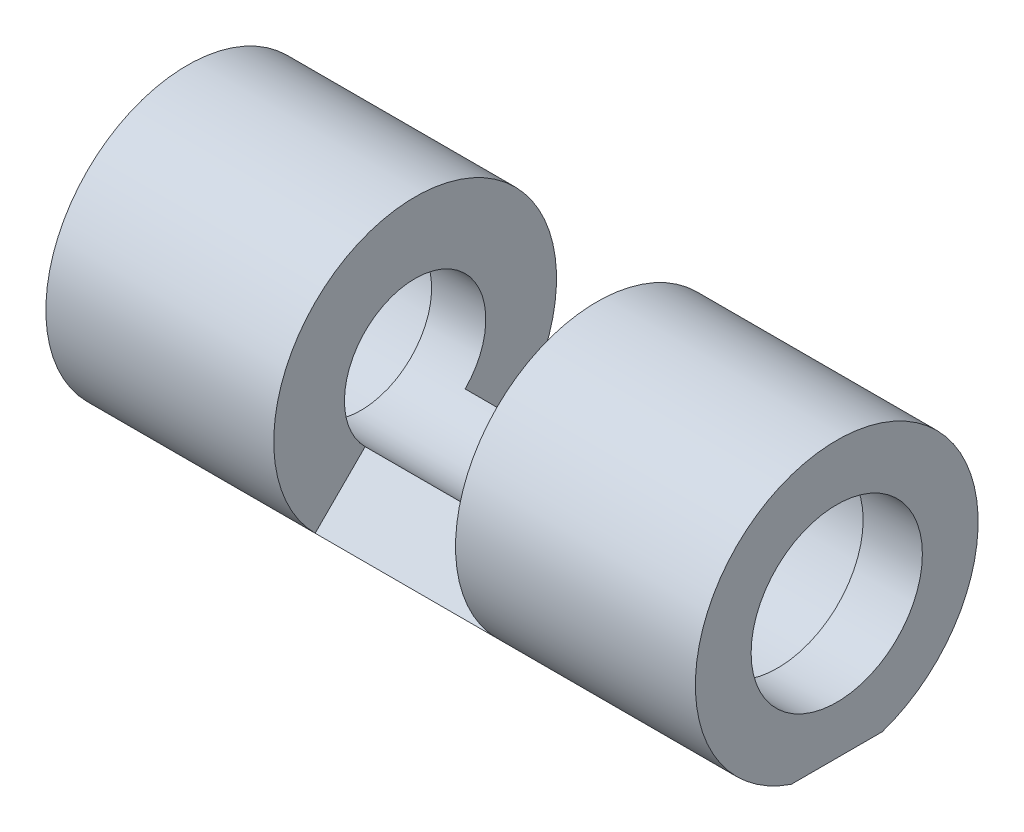
ISO-10303-21;
HEADER;
FILE_DESCRIPTION(('STEP AP214'),'2;1');
FILE_NAME('part.step','',(''),(''),'','','');
FILE_SCHEMA(('AUTOMOTIVE_DESIGN { 1 0 10303 214 1 1 1 1 }'));
ENDSEC;
DATA;
#1=APPLICATION_CONTEXT('core data for automotive mechanical design processes');
#2=APPLICATION_PROTOCOL_DEFINITION('international standard','automotive_design',2000,#1);
#3=PRODUCT_CONTEXT('',#1,'mechanical');
#4=PRODUCT('Part','Part','',(#3));
#5=PRODUCT_RELATED_PRODUCT_CATEGORY('part','',(#4));
#6=PRODUCT_DEFINITION_FORMATION('','',#4);
#7=PRODUCT_DEFINITION_CONTEXT('part definition',#1,'design');
#8=PRODUCT_DEFINITION('design','',#6,#7);
#9=PRODUCT_DEFINITION_SHAPE('','',#8);
#10=(LENGTH_UNIT() NAMED_UNIT(*) SI_UNIT(.MILLI.,.METRE.));
#11=(NAMED_UNIT(*) PLANE_ANGLE_UNIT() SI_UNIT($,.RADIAN.));
#12=(NAMED_UNIT(*) SI_UNIT($,.STERADIAN.) SOLID_ANGLE_UNIT());
#13=UNCERTAINTY_MEASURE_WITH_UNIT(LENGTH_MEASURE(1.E-05),#10,'distance_accuracy_value','');
#14=(GEOMETRIC_REPRESENTATION_CONTEXT(3) GLOBAL_UNCERTAINTY_ASSIGNED_CONTEXT((#13)) GLOBAL_UNIT_ASSIGNED_CONTEXT((#10,
#11,#12)) REPRESENTATION_CONTEXT('',''));
#15=CARTESIAN_POINT('',(0.,0.,0.));
#16=DIRECTION('',(0.,0.,1.));
#17=DIRECTION('',(1.,0.,0.));
#18=AXIS2_PLACEMENT_3D('',#15,#16,#17);
#19=CARTESIAN_POINT('',(21.3682121723614,15.,0.));
#20=DIRECTION('',(-1.,0.,0.));
#21=DIRECTION('',(0.,0.,1.));
#22=AXIS2_PLACEMENT_3D('',#19,#20,#21);
#23=PLANE('',#22);
#24=CARTESIAN_POINT('',(21.3682121723614,0.,0.));
#25=DIRECTION('',(-1.,0.,0.));
#26=DIRECTION('',(0.,0.,1.));
#27=AXIS2_PLACEMENT_3D('',#24,#25,#26);
#28=CIRCLE('',#27,15.);
#29=CARTESIAN_POINT('',(21.3682121723614,0.,15.));
#30=VERTEX_POINT('',#29);
#31=EDGE_CURVE('E106',#30,#30,#28,.T.);
#32=ORIENTED_EDGE('',*,*,#31,.F.);
#33=EDGE_LOOP('',(#32));
#34=FACE_BOUND('',#33,.T.);
#35=CARTESIAN_POINT('',(21.3682121723614,0.,0.));
#36=DIRECTION('',(-1.,0.,0.));
#37=DIRECTION('',(0.,0.,1.));
#38=AXIS2_PLACEMENT_3D('',#35,#36,#37);
#39=CIRCLE('',#38,10.);
#40=CARTESIAN_POINT('',(21.3682121723614,0.,10.));
#41=VERTEX_POINT('',#40);
#42=EDGE_CURVE('E154',#41,#41,#39,.T.);
#43=ORIENTED_EDGE('',*,*,#42,.T.);
#44=EDGE_LOOP('',(#43));
#45=FACE_BOUND('',#44,.T.);
#46=ADVANCED_FACE('F37',(#34,#45),#23,.F.);
#47=CARTESIAN_POINT('',(-29.3839701249643,0.,0.));
#48=DIRECTION('',(-1.,0.,0.));
#49=DIRECTION('',(0.,0.,1.));
#50=AXIS2_PLACEMENT_3D('',#47,#48,#49);
#51=CYLINDRICAL_SURFACE('',#50,15.);
#52=CARTESIAN_POINT('',(37.5600673665024,0.,0.));
#53=DIRECTION('',(-1.,0.,0.));
#54=DIRECTION('',(0.,0.,1.));
#55=AXIS2_PLACEMENT_3D('',#52,#53,#54);
#56=CIRCLE('',#55,15.);
#57=CARTESIAN_POINT('',(37.5600673665024,0.,15.));
#58=VERTEX_POINT('',#57);
#59=EDGE_CURVE('E102',#58,#58,#56,.T.);
#60=ORIENTED_EDGE('',*,*,#59,.F.);
#61=EDGE_LOOP('',(#60));
#62=FACE_BOUND('',#61,.T.);
#63=ORIENTED_EDGE('',*,*,#31,.T.);
#64=EDGE_LOOP('',(#63));
#65=FACE_BOUND('',#64,.T.);
#66=ADVANCED_FACE('F181',(#62,#65),#51,.F.);
#67=CARTESIAN_POINT('',(37.5600673665024,15.,0.));
#68=DIRECTION('',(1.,0.,0.));
#69=DIRECTION('',(0.,0.,-1.));
#70=AXIS2_PLACEMENT_3D('',#67,#68,#69);
#71=PLANE('',#70);
#72=CARTESIAN_POINT('',(37.5600673665024,0.,0.));
#73=DIRECTION('',(1.,0.,0.));
#74=DIRECTION('',(0.,0.,-1.));
#75=AXIS2_PLACEMENT_3D('',#72,#73,#74);
#76=CIRCLE('',#75,12.112305499726);
#77=CARTESIAN_POINT('',(37.5600673665024,0.,-12.112305499726));
#78=VERTEX_POINT('',#77);
#79=EDGE_CURVE('E130',#78,#78,#76,.F.);
#80=ORIENTED_EDGE('',*,*,#79,.F.);
#81=EDGE_LOOP('',(#80));
#82=FACE_BOUND('',#81,.T.);
#83=ORIENTED_EDGE('',*,*,#59,.T.);
#84=EDGE_LOOP('',(#83));
#85=FACE_BOUND('',#84,.T.);
#86=ADVANCED_FACE('F186',(#82,#85),#71,.F.);
#87=CARTESIAN_POINT('',(45.9368923742034,20.,0.));
#88=DIRECTION('',(-1.,0.,0.));
#89=DIRECTION('',(0.,0.,1.));
#90=AXIS2_PLACEMENT_3D('',#87,#88,#89);
#91=PLANE('',#90);
#92=CARTESIAN_POINT('',(45.9368923742034,0.,0.));
#93=DIRECTION('',(-1.,0.,0.));
#94=DIRECTION('',(0.,0.,1.));
#95=AXIS2_PLACEMENT_3D('',#92,#93,#94);
#96=CIRCLE('',#95,12.112305499726);
#97=CARTESIAN_POINT('',(45.9368923742034,0.,12.112305499726));
#98=VERTEX_POINT('',#97);
#99=EDGE_CURVE('E94',#98,#98,#96,.T.);
#100=ORIENTED_EDGE('',*,*,#99,.T.);
#101=EDGE_LOOP('',(#100));
#102=FACE_BOUND('',#101,.T.);
#103=CARTESIAN_POINT('',(45.9368923742034,0.,0.));
#104=DIRECTION('',(-1.,0.,0.));
#105=DIRECTION('',(0.,0.,1.));
#106=AXIS2_PLACEMENT_3D('',#103,#104,#105);
#107=CIRCLE('',#106,20.);
#108=CARTESIAN_POINT('',(45.9368923742034,-18.9369483578658,6.43366045820916));
#109=VERTEX_POINT('',#108);
#110=CARTESIAN_POINT('',(45.9368923742034,-18.9369483578658,-6.43366045820916));
#111=VERTEX_POINT('',#110);
#112=EDGE_CURVE('E99',#109,#111,#107,.T.);
#113=ORIENTED_EDGE('',*,*,#112,.F.);
#114=DIRECTION('',(0.,0.,1.));
#115=VECTOR('',#114,1.);
#116=CARTESIAN_POINT('',(45.9368923742034,-18.9369483578658,23.2785901764984));
#117=LINE('',#116,#115);
#118=EDGE_CURVE('E89',#111,#109,#117,.T.);
#119=ORIENTED_EDGE('',*,*,#118,.F.);
#120=EDGE_LOOP('',(#113,#119));
#121=FACE_BOUND('',#120,.T.);
#122=ADVANCED_FACE('F98',(#102,#121),#91,.F.);
#123=CARTESIAN_POINT('',(-29.3839701249643,0.,0.));
#124=DIRECTION('',(-1.,0.,0.));
#125=DIRECTION('',(0.,0.,1.));
#126=AXIS2_PLACEMENT_3D('',#123,#124,#125);
#127=CYLINDRICAL_SURFACE('',#126,20.);
#128=CARTESIAN_POINT('',(12.0092105655998,0.,0.));
#129=DIRECTION('',(-1.,0.,0.));
#130=DIRECTION('',(0.,0.,1.));
#131=AXIS2_PLACEMENT_3D('',#128,#129,#130);
#132=CIRCLE('',#131,20.);
#133=CARTESIAN_POINT('',(12.0092105655998,-14.1421356237312,14.1421356237307));
#134=VERTEX_POINT('',#133);
#135=CARTESIAN_POINT('',(12.0092105655998,-14.1421356237312,-14.1421356237307));
#136=VERTEX_POINT('',#135);
#137=EDGE_CURVE('E152',#134,#136,#132,.T.);
#138=ORIENTED_EDGE('',*,*,#137,.F.);
#139=DIRECTION('',(-1.,0.,0.));
#140=VECTOR('',#139,1.);
#141=CARTESIAN_POINT('',(-29.3839701249643,-14.1421356237312,14.1421356237307));
#142=LINE('',#141,#140);
#143=CARTESIAN_POINT('',(-13.7019307007708,-14.1421356237312,14.1421356237307));
#144=VERTEX_POINT('',#143);
#145=EDGE_CURVE('E147',#134,#144,#142,.T.);
#146=ORIENTED_EDGE('',*,*,#145,.T.);
#147=CARTESIAN_POINT('',(-13.7019307007708,0.,0.));
#148=DIRECTION('',(1.,0.,0.));
#149=DIRECTION('',(0.,0.,-1.));
#150=AXIS2_PLACEMENT_3D('',#147,#148,#149);
#151=CIRCLE('',#150,20.);
#152=CARTESIAN_POINT('',(-13.7019307007708,-14.1421356237312,-14.1421356237307));
#153=VERTEX_POINT('',#152);
#154=EDGE_CURVE('E150',#153,#144,#151,.T.);
#155=ORIENTED_EDGE('',*,*,#154,.F.);
#156=DIRECTION('',(-1.,0.,0.));
#157=VECTOR('',#156,1.);
#158=CARTESIAN_POINT('',(-29.3839701249643,-14.1421356237312,-14.1421356237307));
#159=LINE('',#158,#157);
#160=EDGE_CURVE('E145',#136,#153,#159,.T.);
#161=ORIENTED_EDGE('',*,*,#160,.F.);
#162=EDGE_LOOP('',(#138,#146,#155,#161));
#163=FACE_BOUND('',#162,.T.);
#164=ORIENTED_EDGE('',*,*,#112,.T.);
#165=DIRECTION('',(-1.,0.,0.));
#166=VECTOR('',#165,1.);
#167=CARTESIAN_POINT('',(-29.3839701249643,-18.9369483578658,-6.43366045820917));
#168=LINE('',#167,#166);
#169=CARTESIAN_POINT('',(-45.9368923742034,-18.9369483578658,-6.43366045820912));
#170=VERTEX_POINT('',#169);
#171=EDGE_CURVE('E86',#111,#170,#168,.T.);
#172=ORIENTED_EDGE('',*,*,#171,.T.);
#173=CARTESIAN_POINT('',(-45.9368923742034,0.,0.));
#174=DIRECTION('',(-1.,0.,0.));
#175=DIRECTION('',(0.,0.,1.));
#176=AXIS2_PLACEMENT_3D('',#173,#174,#175);
#177=CIRCLE('',#176,20.);
#178=CARTESIAN_POINT('',(-45.9368923742034,-18.9369483578658,6.43366045820912));
#179=VERTEX_POINT('',#178);
#180=EDGE_CURVE('E103',#179,#170,#177,.T.);
#181=ORIENTED_EDGE('',*,*,#180,.F.);
#182=DIRECTION('',(-1.,0.,0.));
#183=VECTOR('',#182,1.);
#184=CARTESIAN_POINT('',(-29.3839701249643,-18.9369483578658,6.43366045820917));
#185=LINE('',#184,#183);
#186=EDGE_CURVE('E51',#179,#109,#185,.F.);
#187=ORIENTED_EDGE('',*,*,#186,.T.);
#188=EDGE_LOOP('',(#164,#172,#181,#187));
#189=FACE_BOUND('',#188,.T.);
#190=ADVANCED_FACE('F101',(#163,#189),#127,.T.);
#191=CARTESIAN_POINT('',(-45.9368923742034,20.,0.));
#192=DIRECTION('',(1.,0.,0.));
#193=DIRECTION('',(0.,0.,-1.));
#194=AXIS2_PLACEMENT_3D('',#191,#192,#193);
#195=PLANE('',#194);
#196=CARTESIAN_POINT('',(-45.9368923742034,0.,0.));
#197=DIRECTION('',(-1.,0.,0.));
#198=DIRECTION('',(0.,0.,1.));
#199=AXIS2_PLACEMENT_3D('',#196,#197,#198);
#200=CIRCLE('',#199,12.112305499726);
#201=CARTESIAN_POINT('',(-45.9368923742034,0.,12.112305499726));
#202=VERTEX_POINT('',#201);
#203=EDGE_CURVE('E124',#202,#202,#200,.T.);
#204=ORIENTED_EDGE('',*,*,#203,.F.);
#205=EDGE_LOOP('',(#204));
#206=FACE_BOUND('',#205,.T.);
#207=ORIENTED_EDGE('',*,*,#180,.T.);
#208=DIRECTION('',(0.,0.,1.));
#209=VECTOR('',#208,1.);
#210=CARTESIAN_POINT('',(-45.9368923742034,-18.9369483578658,0.));
#211=LINE('',#210,#209);
#212=EDGE_CURVE('E11',#170,#179,#211,.T.);
#213=ORIENTED_EDGE('',*,*,#212,.T.);
#214=EDGE_LOOP('',(#207,#213));
#215=FACE_BOUND('',#214,.T.);
#216=ADVANCED_FACE('F169',(#206,#215),#195,.F.);
#217=CARTESIAN_POINT('',(-37.5600673665024,15.,0.));
#218=DIRECTION('',(-1.,0.,0.));
#219=DIRECTION('',(0.,0.,1.));
#220=AXIS2_PLACEMENT_3D('',#217,#218,#219);
#221=PLANE('',#220);
#222=CARTESIAN_POINT('',(-37.5600673665024,0.,0.));
#223=DIRECTION('',(-1.,0.,0.));
#224=DIRECTION('',(0.,0.,1.));
#225=AXIS2_PLACEMENT_3D('',#222,#223,#224);
#226=CIRCLE('',#225,12.112305499726);
#227=CARTESIAN_POINT('',(-37.5600673665024,0.,12.112305499726));
#228=VERTEX_POINT('',#227);
#229=EDGE_CURVE('E122',#228,#228,#226,.T.);
#230=ORIENTED_EDGE('',*,*,#229,.T.);
#231=EDGE_LOOP('',(#230));
#232=FACE_BOUND('',#231,.T.);
#233=CARTESIAN_POINT('',(-37.5600673665024,0.,0.));
#234=DIRECTION('',(-1.,0.,0.));
#235=DIRECTION('',(0.,0.,1.));
#236=AXIS2_PLACEMENT_3D('',#233,#234,#235);
#237=CIRCLE('',#236,15.);
#238=CARTESIAN_POINT('',(-37.5600673665024,0.,15.));
#239=VERTEX_POINT('',#238);
#240=EDGE_CURVE('E108',#239,#239,#237,.T.);
#241=ORIENTED_EDGE('',*,*,#240,.F.);
#242=EDGE_LOOP('',(#241));
#243=FACE_BOUND('',#242,.T.);
#244=ADVANCED_FACE('F167',(#232,#243),#221,.F.);
#245=CARTESIAN_POINT('',(-29.3839701249643,0.,0.));
#246=DIRECTION('',(-1.,0.,0.));
#247=DIRECTION('',(0.,0.,1.));
#248=AXIS2_PLACEMENT_3D('',#245,#246,#247);
#249=CYLINDRICAL_SURFACE('',#248,15.);
#250=CARTESIAN_POINT('',(-21.3682121723614,0.,0.));
#251=DIRECTION('',(-1.,0.,0.));
#252=DIRECTION('',(0.,0.,1.));
#253=AXIS2_PLACEMENT_3D('',#250,#251,#252);
#254=CIRCLE('',#253,15.);
#255=CARTESIAN_POINT('',(-21.3682121723614,0.,15.));
#256=VERTEX_POINT('',#255);
#257=EDGE_CURVE('E160',#256,#256,#254,.T.);
#258=ORIENTED_EDGE('',*,*,#257,.F.);
#259=EDGE_LOOP('',(#258));
#260=FACE_BOUND('',#259,.T.);
#261=ORIENTED_EDGE('',*,*,#240,.T.);
#262=EDGE_LOOP('',(#261));
#263=FACE_BOUND('',#262,.T.);
#264=ADVANCED_FACE('F165',(#260,#263),#249,.F.);
#265=CARTESIAN_POINT('',(-21.3682121723614,15.,0.));
#266=DIRECTION('',(1.,0.,0.));
#267=DIRECTION('',(0.,0.,-1.));
#268=AXIS2_PLACEMENT_3D('',#265,#266,#267);
#269=PLANE('',#268);
#270=CARTESIAN_POINT('',(-21.3682121723614,0.,0.));
#271=DIRECTION('',(-1.,0.,0.));
#272=DIRECTION('',(0.,0.,1.));
#273=AXIS2_PLACEMENT_3D('',#270,#271,#272);
#274=CIRCLE('',#273,10.);
#275=CARTESIAN_POINT('',(-21.3682121723614,0.,10.));
#276=VERTEX_POINT('',#275);
#277=EDGE_CURVE('E157',#276,#276,#274,.T.);
#278=ORIENTED_EDGE('',*,*,#277,.F.);
#279=EDGE_LOOP('',(#278));
#280=FACE_BOUND('',#279,.T.);
#281=ORIENTED_EDGE('',*,*,#257,.T.);
#282=EDGE_LOOP('',(#281));
#283=FACE_BOUND('',#282,.T.);
#284=ADVANCED_FACE('F175',(#280,#283),#269,.F.);
#285=CARTESIAN_POINT('',(-29.3839701249643,0.,0.));
#286=DIRECTION('',(-1.,0.,0.));
#287=DIRECTION('',(0.,0.,1.));
#288=AXIS2_PLACEMENT_3D('',#285,#286,#287);
#289=CYLINDRICAL_SURFACE('',#288,10.);
#290=CARTESIAN_POINT('',(-13.7019307007708,0.,0.));
#291=DIRECTION('',(1.,0.,0.));
#292=DIRECTION('',(0.,0.,-1.));
#293=AXIS2_PLACEMENT_3D('',#290,#291,#292);
#294=CIRCLE('',#293,10.);
#295=CARTESIAN_POINT('',(-13.7019307007708,-7.07106781186559,7.07106781186537));
#296=VERTEX_POINT('',#295);
#297=CARTESIAN_POINT('',(-13.7019307007708,-7.07106781186559,-7.07106781186537));
#298=VERTEX_POINT('',#297);
#299=EDGE_CURVE('E116',#296,#298,#294,.F.);
#300=ORIENTED_EDGE('',*,*,#299,.F.);
#301=DIRECTION('',(-1.,0.,0.));
#302=VECTOR('',#301,1.);
#303=CARTESIAN_POINT('',(-29.3839701249643,-7.07106781186559,7.07106781186537));
#304=LINE('',#303,#302);
#305=CARTESIAN_POINT('',(12.0092105655998,-7.07106781186559,7.07106781186537));
#306=VERTEX_POINT('',#305);
#307=EDGE_CURVE('E44',#296,#306,#304,.F.);
#308=ORIENTED_EDGE('',*,*,#307,.T.);
#309=CARTESIAN_POINT('',(12.0092105655998,0.,0.));
#310=DIRECTION('',(-1.,0.,0.));
#311=DIRECTION('',(0.,0.,1.));
#312=AXIS2_PLACEMENT_3D('',#309,#310,#311);
#313=CIRCLE('',#312,10.);
#314=CARTESIAN_POINT('',(12.0092105655998,-7.07106781186559,-7.07106781186537));
#315=VERTEX_POINT('',#314);
#316=EDGE_CURVE('E119',#315,#306,#313,.F.);
#317=ORIENTED_EDGE('',*,*,#316,.F.);
#318=DIRECTION('',(-1.,0.,0.));
#319=VECTOR('',#318,1.);
#320=CARTESIAN_POINT('',(-29.3839701249643,-7.07106781186559,-7.07106781186537));
#321=LINE('',#320,#319);
#322=EDGE_CURVE('E114',#298,#315,#321,.F.);
#323=ORIENTED_EDGE('',*,*,#322,.F.);
#324=EDGE_LOOP('',(#300,#308,#317,#323));
#325=FACE_BOUND('',#324,.T.);
#326=ORIENTED_EDGE('',*,*,#42,.F.);
#327=EDGE_LOOP('',(#326));
#328=FACE_BOUND('',#327,.T.);
#329=ORIENTED_EDGE('',*,*,#277,.T.);
#330=EDGE_LOOP('',(#329));
#331=FACE_BOUND('',#330,.T.);
#332=ADVANCED_FACE('F192',(#325,#328,#331),#289,.F.);
#333=CARTESIAN_POINT('',(12.0092105655998,-6.25976068644332,6.25976068644312));
#334=DIRECTION('',(-1.,0.,0.));
#335=DIRECTION('',(0.,0.,1.));
#336=AXIS2_PLACEMENT_3D('',#333,#334,#335);
#337=PLANE('',#336);
#338=ORIENTED_EDGE('',*,*,#137,.T.);
#339=DIRECTION('',(0.,-0.707106781186559,-0.707106781186536));
#340=VECTOR('',#339,1.);
#341=CARTESIAN_POINT('',(12.0092105655998,-6.25976068644332,-6.25976068644312));
#342=LINE('',#341,#340);
#343=EDGE_CURVE('E58',#315,#136,#342,.T.);
#344=ORIENTED_EDGE('',*,*,#343,.F.);
#345=ORIENTED_EDGE('',*,*,#316,.T.);
#346=DIRECTION('',(0.,-0.707106781186559,0.707106781186536));
#347=VECTOR('',#346,1.);
#348=CARTESIAN_POINT('',(12.0092105655998,-6.25976068644332,6.25976068644312));
#349=LINE('',#348,#347);
#350=EDGE_CURVE('E139',#306,#134,#349,.T.);
#351=ORIENTED_EDGE('',*,*,#350,.T.);
#352=EDGE_LOOP('',(#338,#344,#345,#351));
#353=FACE_BOUND('',#352,.T.);
#354=ADVANCED_FACE('F195',(#353),#337,.T.);
#355=CARTESIAN_POINT('',(-13.7019307007708,-18.2349550431175,18.2349550431169));
#356=DIRECTION('',(1.,0.,0.));
#357=DIRECTION('',(0.,0.,-1.));
#358=AXIS2_PLACEMENT_3D('',#355,#356,#357);
#359=PLANE('',#358);
#360=ORIENTED_EDGE('',*,*,#154,.T.);
#361=DIRECTION('',(0.,0.707106781186559,-0.707106781186536));
#362=VECTOR('',#361,1.);
#363=CARTESIAN_POINT('',(-13.7019307007708,-18.2349550431175,18.2349550431169));
#364=LINE('',#363,#362);
#365=EDGE_CURVE('E142',#144,#296,#364,.T.);
#366=ORIENTED_EDGE('',*,*,#365,.T.);
#367=ORIENTED_EDGE('',*,*,#299,.T.);
#368=DIRECTION('',(0.,0.707106781186559,0.707106781186536));
#369=VECTOR('',#368,1.);
#370=CARTESIAN_POINT('',(-13.7019307007708,-18.2349550431175,-18.2349550431169));
#371=LINE('',#370,#369);
#372=EDGE_CURVE('E127',#153,#298,#371,.T.);
#373=ORIENTED_EDGE('',*,*,#372,.F.);
#374=EDGE_LOOP('',(#360,#366,#367,#373));
#375=FACE_BOUND('',#374,.T.);
#376=ADVANCED_FACE('F209',(#375),#359,.T.);
#377=CARTESIAN_POINT('',(0.,0.,0.));
#378=DIRECTION('',(0.,-0.707106781186536,-0.707106781186559));
#379=DIRECTION('',(1.,0.,0.));
#380=AXIS2_PLACEMENT_3D('',#377,#378,#379);
#381=PLANE('',#380);
#382=ORIENTED_EDGE('',*,*,#350,.F.);
#383=ORIENTED_EDGE('',*,*,#307,.F.);
#384=ORIENTED_EDGE('',*,*,#365,.F.);
#385=ORIENTED_EDGE('',*,*,#145,.F.);
#386=EDGE_LOOP('',(#382,#383,#384,#385));
#387=FACE_BOUND('',#386,.T.);
#388=ADVANCED_FACE('F213',(#387),#381,.F.);
#389=CARTESIAN_POINT('',(0.,0.,0.));
#390=DIRECTION('',(0.,0.707106781186536,-0.707106781186559));
#391=DIRECTION('',(1.,0.,0.));
#392=AXIS2_PLACEMENT_3D('',#389,#390,#391);
#393=PLANE('',#392);
#394=ORIENTED_EDGE('',*,*,#160,.T.);
#395=ORIENTED_EDGE('',*,*,#372,.T.);
#396=ORIENTED_EDGE('',*,*,#322,.T.);
#397=ORIENTED_EDGE('',*,*,#343,.T.);
#398=EDGE_LOOP('',(#394,#395,#396,#397));
#399=FACE_BOUND('',#398,.T.);
#400=ADVANCED_FACE('F217',(#399),#393,.T.);
#401=CARTESIAN_POINT('',(-33.9368923742034,0.,0.));
#402=DIRECTION('',(-1.,0.,0.));
#403=DIRECTION('',(0.,0.,1.));
#404=AXIS2_PLACEMENT_3D('',#401,#402,#403);
#405=CYLINDRICAL_SURFACE('',#404,12.112305499726);
#406=ORIENTED_EDGE('',*,*,#203,.T.);
#407=EDGE_LOOP('',(#406));
#408=FACE_BOUND('',#407,.T.);
#409=ORIENTED_EDGE('',*,*,#229,.F.);
#410=EDGE_LOOP('',(#409));
#411=FACE_BOUND('',#410,.T.);
#412=ADVANCED_FACE('F221',(#408,#411),#405,.F.);
#413=CARTESIAN_POINT('',(33.9368923742034,0.,0.));
#414=DIRECTION('',(1.,0.,0.));
#415=DIRECTION('',(0.,0.,-1.));
#416=AXIS2_PLACEMENT_3D('',#413,#414,#415);
#417=CYLINDRICAL_SURFACE('',#416,12.112305499726);
#418=ORIENTED_EDGE('',*,*,#99,.F.);
#419=EDGE_LOOP('',(#418));
#420=FACE_BOUND('',#419,.T.);
#421=ORIENTED_EDGE('',*,*,#79,.T.);
#422=EDGE_LOOP('',(#421));
#423=FACE_BOUND('',#422,.T.);
#424=ADVANCED_FACE('F224',(#420,#423),#417,.F.);
#425=CARTESIAN_POINT('',(-45.9368923742034,-18.9369483578658,23.2785901764984));
#426=DIRECTION('',(0.,1.,0.));
#427=DIRECTION('',(0.,0.,1.));
#428=AXIS2_PLACEMENT_3D('',#425,#426,#427);
#429=PLANE('',#428);
#430=ORIENTED_EDGE('',*,*,#118,.T.);
#431=ORIENTED_EDGE('',*,*,#186,.F.);
#432=ORIENTED_EDGE('',*,*,#212,.F.);
#433=ORIENTED_EDGE('',*,*,#171,.F.);
#434=EDGE_LOOP('',(#430,#431,#432,#433));
#435=FACE_BOUND('',#434,.T.);
#436=ADVANCED_FACE('F88',(#435),#429,.F.);
#437=CLOSED_SHELL('',(#46,#66,#86,#122,#190,#216,#244,#264,#284,#332,#354,#376,#388,#400,#412,
#424,#436));
#438=MANIFOLD_SOLID_BREP('B2',#437);
#439=ADVANCED_BREP_SHAPE_REPRESENTATION('',(#18,#438),#14);
#440=SHAPE_DEFINITION_REPRESENTATION(#9,#439);
ENDSEC;
END-ISO-10303-21;
